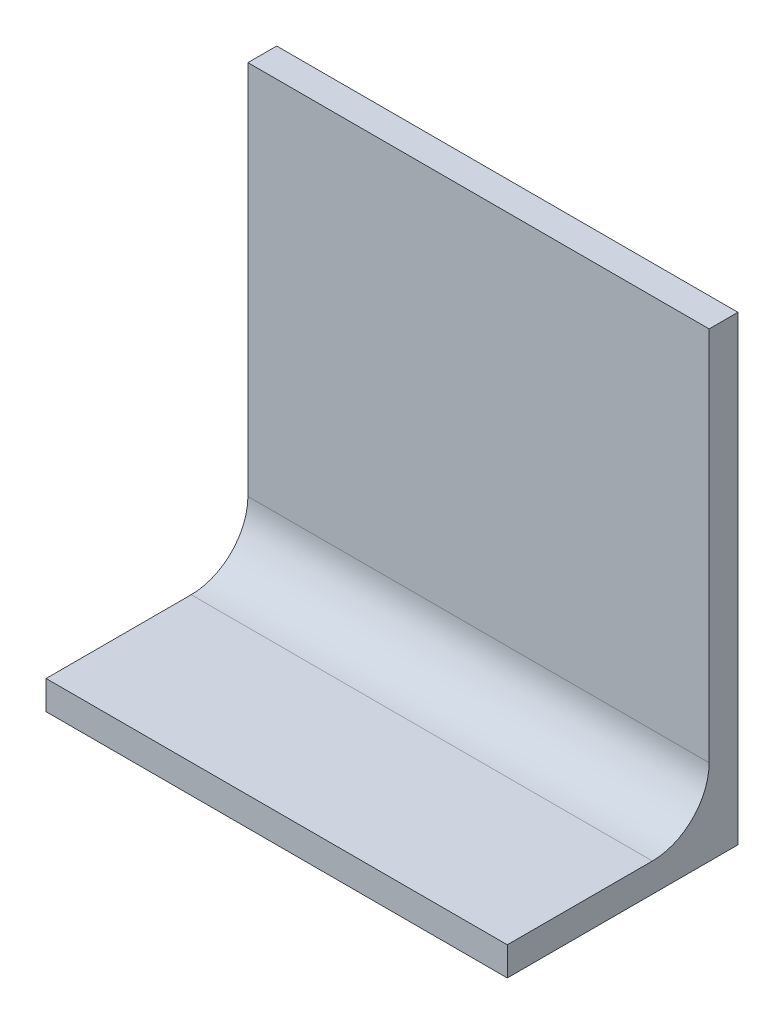
ISO-10303-21;
HEADER;
FILE_DESCRIPTION(('STEP AP214'),'2;1');
FILE_NAME('part.step','',(''),(''),'','','');
FILE_SCHEMA(('AUTOMOTIVE_DESIGN { 1 0 10303 214 1 1 1 1 }'));
ENDSEC;
DATA;
#1=APPLICATION_CONTEXT('core data for automotive mechanical design processes');
#2=APPLICATION_PROTOCOL_DEFINITION('international standard','automotive_design',2000,#1);
#3=PRODUCT_CONTEXT('',#1,'mechanical');
#4=PRODUCT('Part','Part','',(#3));
#5=PRODUCT_RELATED_PRODUCT_CATEGORY('part','',(#4));
#6=PRODUCT_DEFINITION_FORMATION('','',#4);
#7=PRODUCT_DEFINITION_CONTEXT('part definition',#1,'design');
#8=PRODUCT_DEFINITION('design','',#6,#7);
#9=PRODUCT_DEFINITION_SHAPE('','',#8);
#10=(LENGTH_UNIT() NAMED_UNIT(*) SI_UNIT(.MILLI.,.METRE.));
#11=(NAMED_UNIT(*) PLANE_ANGLE_UNIT() SI_UNIT($,.RADIAN.));
#12=(NAMED_UNIT(*) SI_UNIT($,.STERADIAN.) SOLID_ANGLE_UNIT());
#13=UNCERTAINTY_MEASURE_WITH_UNIT(LENGTH_MEASURE(1.E-05),#10,'distance_accuracy_value','');
#14=(GEOMETRIC_REPRESENTATION_CONTEXT(3) GLOBAL_UNCERTAINTY_ASSIGNED_CONTEXT((#13)) GLOBAL_UNIT_ASSIGNED_CONTEXT((#10,
#11,#12)) REPRESENTATION_CONTEXT('',''));
#15=CARTESIAN_POINT('',(0.,0.,0.));
#16=DIRECTION('',(0.,0.,1.));
#17=DIRECTION('',(1.,0.,0.));
#18=AXIS2_PLACEMENT_3D('',#15,#16,#17);
#19=CARTESIAN_POINT('',(25.4,0.,0.));
#20=DIRECTION('',(0.,0.,-1.));
#21=DIRECTION('',(-1.,0.,0.));
#22=AXIS2_PLACEMENT_3D('',#19,#20,#21);
#23=PLANE('',#22);
#24=DIRECTION('',(0.,-1.,0.));
#25=VECTOR('',#24,1.);
#26=CARTESIAN_POINT('',(-25.4,0.,0.));
#27=LINE('',#26,#25);
#28=CARTESIAN_POINT('',(-25.4,0.,0.));
#29=VERTEX_POINT('',#28);
#30=CARTESIAN_POINT('',(-25.4,-3.17,0.));
#31=VERTEX_POINT('',#30);
#32=EDGE_CURVE('E117',#29,#31,#27,.T.);
#33=ORIENTED_EDGE('',*,*,#32,.T.);
#34=DIRECTION('',(-1.,0.,0.));
#35=VECTOR('',#34,1.);
#36=CARTESIAN_POINT('',(25.4,-3.17,0.));
#37=LINE('',#36,#35);
#38=CARTESIAN_POINT('',(25.4,-3.17,0.));
#39=VERTEX_POINT('',#38);
#40=EDGE_CURVE('E98',#39,#31,#37,.T.);
#41=ORIENTED_EDGE('',*,*,#40,.F.);
#42=DIRECTION('',(0.,-1.,0.));
#43=VECTOR('',#42,1.);
#44=CARTESIAN_POINT('',(25.4,0.,0.));
#45=LINE('',#44,#43);
#46=CARTESIAN_POINT('',(25.4,0.,0.));
#47=VERTEX_POINT('',#46);
#48=EDGE_CURVE('E105',#47,#39,#45,.T.);
#49=ORIENTED_EDGE('',*,*,#48,.F.);
#50=DIRECTION('',(-1.,0.,0.));
#51=VECTOR('',#50,1.);
#52=CARTESIAN_POINT('',(25.4,0.,0.));
#53=LINE('',#52,#51);
#54=EDGE_CURVE('E131',#47,#29,#53,.T.);
#55=ORIENTED_EDGE('',*,*,#54,.T.);
#56=EDGE_LOOP('',(#33,#41,#49,#55));
#57=FACE_BOUND('',#56,.T.);
#58=ADVANCED_FACE('F35',(#57),#23,.F.);
#59=CARTESIAN_POINT('',(25.4,-3.17,0.));
#60=DIRECTION('',(0.,1.,0.));
#61=DIRECTION('',(0.,0.,1.));
#62=AXIS2_PLACEMENT_3D('',#59,#60,#61);
#63=PLANE('',#62);
#64=DIRECTION('',(0.,0.,-1.));
#65=VECTOR('',#64,1.);
#66=CARTESIAN_POINT('',(-25.4,-3.17,0.));
#67=LINE('',#66,#65);
#68=CARTESIAN_POINT('',(-25.4,-3.17,-25.4));
#69=VERTEX_POINT('',#68);
#70=EDGE_CURVE('E140',#31,#69,#67,.T.);
#71=ORIENTED_EDGE('',*,*,#70,.T.);
#72=DIRECTION('',(-1.,0.,0.));
#73=VECTOR('',#72,1.);
#74=CARTESIAN_POINT('',(25.4,-3.17,-25.4));
#75=LINE('',#74,#73);
#76=CARTESIAN_POINT('',(25.4,-3.17,-25.4));
#77=VERTEX_POINT('',#76);
#78=EDGE_CURVE('E101',#77,#69,#75,.T.);
#79=ORIENTED_EDGE('',*,*,#78,.F.);
#80=DIRECTION('',(0.,0.,-1.));
#81=VECTOR('',#80,1.);
#82=CARTESIAN_POINT('',(25.4,-3.17,0.));
#83=LINE('',#82,#81);
#84=EDGE_CURVE('E94',#39,#77,#83,.T.);
#85=ORIENTED_EDGE('',*,*,#84,.F.);
#86=ORIENTED_EDGE('',*,*,#40,.T.);
#87=EDGE_LOOP('',(#71,#79,#85,#86));
#88=FACE_BOUND('',#87,.T.);
#89=ADVANCED_FACE('F96',(#88),#63,.F.);
#90=CARTESIAN_POINT('',(25.4,-3.17,-25.4));
#91=DIRECTION('',(0.,0.,1.));
#92=DIRECTION('',(1.,0.,0.));
#93=AXIS2_PLACEMENT_3D('',#90,#91,#92);
#94=PLANE('',#93);
#95=DIRECTION('',(0.,1.,0.));
#96=VECTOR('',#95,1.);
#97=CARTESIAN_POINT('',(-25.4,-3.17,-25.4));
#98=LINE('',#97,#96);
#99=CARTESIAN_POINT('',(-25.4,47.63,-25.4));
#100=VERTEX_POINT('',#99);
#101=EDGE_CURVE('E138',#69,#100,#98,.T.);
#102=ORIENTED_EDGE('',*,*,#101,.T.);
#103=DIRECTION('',(-1.,0.,0.));
#104=VECTOR('',#103,1.);
#105=CARTESIAN_POINT('',(25.4,47.63,-25.4));
#106=LINE('',#105,#104);
#107=CARTESIAN_POINT('',(25.4,47.63,-25.4));
#108=VERTEX_POINT('',#107);
#109=EDGE_CURVE('E122',#108,#100,#106,.T.);
#110=ORIENTED_EDGE('',*,*,#109,.F.);
#111=DIRECTION('',(0.,1.,0.));
#112=VECTOR('',#111,1.);
#113=CARTESIAN_POINT('',(25.4,-3.17,-25.4));
#114=LINE('',#113,#112);
#115=EDGE_CURVE('E104',#77,#108,#114,.T.);
#116=ORIENTED_EDGE('',*,*,#115,.F.);
#117=ORIENTED_EDGE('',*,*,#78,.T.);
#118=EDGE_LOOP('',(#102,#110,#116,#117));
#119=FACE_BOUND('',#118,.T.);
#120=ADVANCED_FACE('F152',(#119),#94,.F.);
#121=CARTESIAN_POINT('',(25.4,47.63,-22.23));
#122=DIRECTION('',(0.,-1.,0.));
#123=DIRECTION('',(0.,0.,-1.));
#124=AXIS2_PLACEMENT_3D('',#121,#122,#123);
#125=PLANE('',#124);
#126=DIRECTION('',(0.,0.,1.));
#127=VECTOR('',#126,1.);
#128=CARTESIAN_POINT('',(-25.4,47.63,-22.23));
#129=LINE('',#128,#127);
#130=CARTESIAN_POINT('',(-25.4,47.63,-22.23));
#131=VERTEX_POINT('',#130);
#132=EDGE_CURVE('E136',#100,#131,#129,.T.);
#133=ORIENTED_EDGE('',*,*,#132,.T.);
#134=DIRECTION('',(-1.,0.,0.));
#135=VECTOR('',#134,1.);
#136=CARTESIAN_POINT('',(25.4,47.63,-22.23));
#137=LINE('',#136,#135);
#138=CARTESIAN_POINT('',(25.4,47.63,-22.23));
#139=VERTEX_POINT('',#138);
#140=EDGE_CURVE('E128',#139,#131,#137,.T.);
#141=ORIENTED_EDGE('',*,*,#140,.F.);
#142=DIRECTION('',(0.,0.,1.));
#143=VECTOR('',#142,1.);
#144=CARTESIAN_POINT('',(25.4,47.63,-22.23));
#145=LINE('',#144,#143);
#146=EDGE_CURVE('E146',#108,#139,#145,.T.);
#147=ORIENTED_EDGE('',*,*,#146,.F.);
#148=ORIENTED_EDGE('',*,*,#109,.T.);
#149=EDGE_LOOP('',(#133,#141,#147,#148));
#150=FACE_BOUND('',#149,.T.);
#151=ADVANCED_FACE('F156',(#150),#125,.F.);
#152=CARTESIAN_POINT('',(25.4,0.,-22.23));
#153=DIRECTION('',(0.,0.,-1.));
#154=DIRECTION('',(-1.,0.,0.));
#155=AXIS2_PLACEMENT_3D('',#152,#153,#154);
#156=PLANE('',#155);
#157=DIRECTION('',(0.,-1.,0.));
#158=VECTOR('',#157,1.);
#159=CARTESIAN_POINT('',(-25.4,0.,-22.23));
#160=LINE('',#159,#158);
#161=CARTESIAN_POINT('',(-25.4,6.25,-22.23));
#162=VERTEX_POINT('',#161);
#163=EDGE_CURVE('E134',#131,#162,#160,.T.);
#164=ORIENTED_EDGE('',*,*,#163,.T.);
#165=DIRECTION('',(-1.,0.,0.));
#166=VECTOR('',#165,1.);
#167=CARTESIAN_POINT('',(25.4,6.25,-22.23));
#168=LINE('',#167,#166);
#169=CARTESIAN_POINT('',(25.4,6.25,-22.23));
#170=VERTEX_POINT('',#169);
#171=EDGE_CURVE('E50',#162,#170,#168,.F.);
#172=ORIENTED_EDGE('',*,*,#171,.T.);
#173=DIRECTION('',(0.,-1.,0.));
#174=VECTOR('',#173,1.);
#175=CARTESIAN_POINT('',(25.4,0.,-22.23));
#176=LINE('',#175,#174);
#177=EDGE_CURVE('E144',#139,#170,#176,.T.);
#178=ORIENTED_EDGE('',*,*,#177,.F.);
#179=ORIENTED_EDGE('',*,*,#140,.T.);
#180=EDGE_LOOP('',(#164,#172,#178,#179));
#181=FACE_BOUND('',#180,.T.);
#182=ADVANCED_FACE('F157',(#181),#156,.F.);
#183=CARTESIAN_POINT('',(25.4,0.,0.));
#184=DIRECTION('',(0.,-1.,0.));
#185=DIRECTION('',(0.,0.,-1.));
#186=AXIS2_PLACEMENT_3D('',#183,#184,#185);
#187=PLANE('',#186);
#188=DIRECTION('',(0.,0.,1.));
#189=VECTOR('',#188,1.);
#190=CARTESIAN_POINT('',(25.4,0.,0.));
#191=LINE('',#190,#189);
#192=CARTESIAN_POINT('',(25.4,0.,-15.98));
#193=VERTEX_POINT('',#192);
#194=EDGE_CURVE('E110',#193,#47,#191,.T.);
#195=ORIENTED_EDGE('',*,*,#194,.F.);
#196=DIRECTION('',(-1.,0.,0.));
#197=VECTOR('',#196,1.);
#198=CARTESIAN_POINT('',(-25.4,0.,-15.98));
#199=LINE('',#198,#197);
#200=CARTESIAN_POINT('',(-25.4,0.,-15.98));
#201=VERTEX_POINT('',#200);
#202=EDGE_CURVE('E118',#193,#201,#199,.T.);
#203=ORIENTED_EDGE('',*,*,#202,.T.);
#204=DIRECTION('',(0.,0.,1.));
#205=VECTOR('',#204,1.);
#206=CARTESIAN_POINT('',(-25.4,0.,0.));
#207=LINE('',#206,#205);
#208=EDGE_CURVE('E114',#201,#29,#207,.T.);
#209=ORIENTED_EDGE('',*,*,#208,.T.);
#210=ORIENTED_EDGE('',*,*,#54,.F.);
#211=EDGE_LOOP('',(#195,#203,#209,#210));
#212=FACE_BOUND('',#211,.T.);
#213=ADVANCED_FACE('F162',(#212),#187,.F.);
#214=CARTESIAN_POINT('',(25.4,0.,0.));
#215=DIRECTION('',(1.,0.,0.));
#216=DIRECTION('',(0.,0.,-1.));
#217=AXIS2_PLACEMENT_3D('',#214,#215,#216);
#218=PLANE('',#217);
#219=ORIENTED_EDGE('',*,*,#48,.T.);
#220=ORIENTED_EDGE('',*,*,#84,.T.);
#221=ORIENTED_EDGE('',*,*,#115,.T.);
#222=ORIENTED_EDGE('',*,*,#146,.T.);
#223=ORIENTED_EDGE('',*,*,#177,.T.);
#224=CARTESIAN_POINT('',(25.4,6.25,-15.98));
#225=DIRECTION('',(1.,0.,0.));
#226=DIRECTION('',(0.,0.,-1.));
#227=AXIS2_PLACEMENT_3D('',#224,#225,#226);
#228=CIRCLE('',#227,6.25);
#229=EDGE_CURVE('E11',#170,#193,#228,.F.);
#230=ORIENTED_EDGE('',*,*,#229,.T.);
#231=ORIENTED_EDGE('',*,*,#194,.T.);
#232=EDGE_LOOP('',(#219,#220,#221,#222,#223,#230,#231));
#233=FACE_BOUND('',#232,.T.);
#234=ADVANCED_FACE('F108',(#233),#218,.T.);
#235=CARTESIAN_POINT('',(-25.4,0.,0.));
#236=DIRECTION('',(1.,0.,0.));
#237=DIRECTION('',(0.,0.,-1.));
#238=AXIS2_PLACEMENT_3D('',#235,#236,#237);
#239=PLANE('',#238);
#240=ORIENTED_EDGE('',*,*,#32,.F.);
#241=ORIENTED_EDGE('',*,*,#208,.F.);
#242=CARTESIAN_POINT('',(-25.4,6.25,-15.98));
#243=DIRECTION('',(1.,0.,0.));
#244=DIRECTION('',(0.,0.,-1.));
#245=AXIS2_PLACEMENT_3D('',#242,#243,#244);
#246=CIRCLE('',#245,6.25);
#247=EDGE_CURVE('E43',#201,#162,#246,.T.);
#248=ORIENTED_EDGE('',*,*,#247,.T.);
#249=ORIENTED_EDGE('',*,*,#163,.F.);
#250=ORIENTED_EDGE('',*,*,#132,.F.);
#251=ORIENTED_EDGE('',*,*,#101,.F.);
#252=ORIENTED_EDGE('',*,*,#70,.F.);
#253=EDGE_LOOP('',(#240,#241,#248,#249,#250,#251,#252));
#254=FACE_BOUND('',#253,.T.);
#255=ADVANCED_FACE('F163',(#254),#239,.F.);
#256=CARTESIAN_POINT('',(25.4,6.25,-15.98));
#257=DIRECTION('',(1.,0.,0.));
#258=DIRECTION('',(0.,0.,-1.));
#259=AXIS2_PLACEMENT_3D('',#256,#257,#258);
#260=CYLINDRICAL_SURFACE('',#259,6.25);
#261=ORIENTED_EDGE('',*,*,#229,.F.);
#262=ORIENTED_EDGE('',*,*,#171,.F.);
#263=ORIENTED_EDGE('',*,*,#247,.F.);
#264=ORIENTED_EDGE('',*,*,#202,.F.);
#265=EDGE_LOOP('',(#261,#262,#263,#264));
#266=FACE_BOUND('',#265,.T.);
#267=ADVANCED_FACE('F37',(#266),#260,.F.);
#268=CLOSED_SHELL('',(#58,#89,#120,#151,#182,#213,#234,#255,#267));
#269=MANIFOLD_SOLID_BREP('B2',#268);
#270=ADVANCED_BREP_SHAPE_REPRESENTATION('',(#18,#269),#14);
#271=SHAPE_DEFINITION_REPRESENTATION(#9,#270);
ENDSEC;
END-ISO-10303-21;
